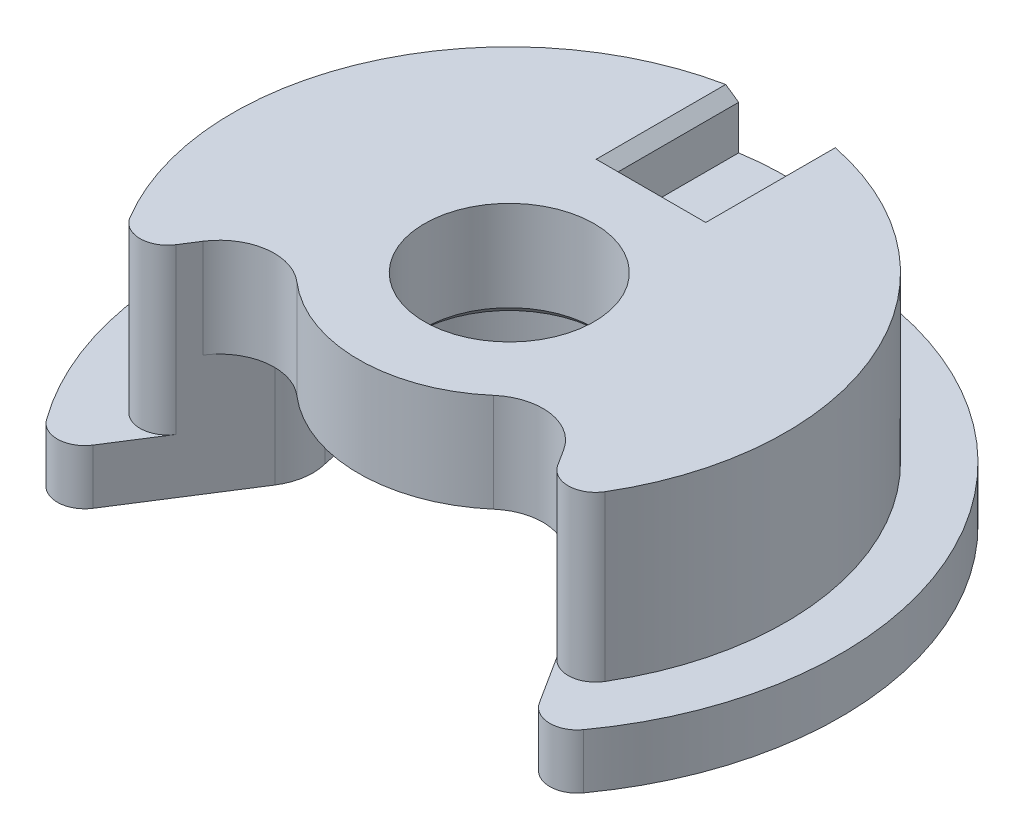
ISO-10303-21;
HEADER;
FILE_DESCRIPTION(('STEP AP214'),'2;1');
FILE_NAME('part.step','',(''),(''),'','','');
FILE_SCHEMA(('AUTOMOTIVE_DESIGN { 1 0 10303 214 1 1 1 1 }'));
ENDSEC;
DATA;
#1=APPLICATION_CONTEXT('core data for automotive mechanical design processes');
#2=APPLICATION_PROTOCOL_DEFINITION('international standard','automotive_design',2000,#1);
#3=PRODUCT_CONTEXT('',#1,'mechanical');
#4=PRODUCT('Part','Part','',(#3));
#5=PRODUCT_RELATED_PRODUCT_CATEGORY('part','',(#4));
#6=PRODUCT_DEFINITION_FORMATION('','',#4);
#7=PRODUCT_DEFINITION_CONTEXT('part definition',#1,'design');
#8=PRODUCT_DEFINITION('design','',#6,#7);
#9=PRODUCT_DEFINITION_SHAPE('','',#8);
#10=(LENGTH_UNIT() NAMED_UNIT(*) SI_UNIT(.MILLI.,.METRE.));
#11=(NAMED_UNIT(*) PLANE_ANGLE_UNIT() SI_UNIT($,.RADIAN.));
#12=(NAMED_UNIT(*) SI_UNIT($,.STERADIAN.) SOLID_ANGLE_UNIT());
#13=UNCERTAINTY_MEASURE_WITH_UNIT(LENGTH_MEASURE(1.E-05),#10,'distance_accuracy_value','');
#14=(GEOMETRIC_REPRESENTATION_CONTEXT(3) GLOBAL_UNCERTAINTY_ASSIGNED_CONTEXT((#13)) GLOBAL_UNIT_ASSIGNED_CONTEXT((#10,
#11,#12)) REPRESENTATION_CONTEXT('',''));
#15=CARTESIAN_POINT('',(0.,0.,0.));
#16=DIRECTION('',(0.,0.,1.));
#17=DIRECTION('',(1.,0.,0.));
#18=AXIS2_PLACEMENT_3D('',#15,#16,#17);
#19=CARTESIAN_POINT('',(0.,3.,0.));
#20=DIRECTION('',(0.,1.,0.));
#21=DIRECTION('',(0.,0.,1.));
#22=AXIS2_PLACEMENT_3D('',#19,#20,#21);
#23=PLANE('',#22);
#24=DIRECTION('',(0.,0.,-1.));
#25=VECTOR('',#24,1.);
#26=CARTESIAN_POINT('',(0.8,3.,-2.786231041578));
#27=LINE('',#26,#25);
#28=CARTESIAN_POINT('',(0.8,3.,-2.786231041578));
#29=VERTEX_POINT('',#28);
#30=CARTESIAN_POINT('',(0.8,3.,-4.9862310415782));
#31=VERTEX_POINT('',#30);
#32=EDGE_CURVE('E226',#29,#31,#27,.T.);
#33=ORIENTED_EDGE('',*,*,#32,.T.);
#34=CARTESIAN_POINT('',(0.,3.,0.));
#35=DIRECTION('',(0.,-1.,0.));
#36=DIRECTION('',(0.,0.,-1.));
#37=AXIS2_PLACEMENT_3D('',#34,#35,#36);
#38=CIRCLE('',#37,5.05);
#39=CARTESIAN_POINT('',(-0.8,3.,-4.9862310415782));
#40=VERTEX_POINT('',#39);
#41=EDGE_CURVE('E20',#31,#40,#38,.F.);
#42=ORIENTED_EDGE('',*,*,#41,.T.);
#43=DIRECTION('',(0.,0.,1.));
#44=VECTOR('',#43,1.);
#45=CARTESIAN_POINT('',(-0.8,3.,-4.986231041578));
#46=LINE('',#45,#44);
#47=CARTESIAN_POINT('',(-0.8,3.,-2.786231041578));
#48=VERTEX_POINT('',#47);
#49=EDGE_CURVE('E235',#40,#48,#46,.T.);
#50=ORIENTED_EDGE('',*,*,#49,.T.);
#51=DIRECTION('',(1.,0.,0.));
#52=VECTOR('',#51,1.);
#53=CARTESIAN_POINT('',(-0.8,3.,-2.786231041578));
#54=LINE('',#53,#52);
#55=EDGE_CURVE('E159',#48,#29,#54,.T.);
#56=ORIENTED_EDGE('',*,*,#55,.T.);
#57=EDGE_LOOP('',(#33,#42,#50,#56));
#58=FACE_BOUND('',#57,.T.);
#59=ADVANCED_FACE('F17',(#58),#23,.T.);
#60=CARTESIAN_POINT('',(-0.8,4.,-2.786231041578));
#61=DIRECTION('',(0.,0.,1.));
#62=DIRECTION('',(1.,0.,0.));
#63=AXIS2_PLACEMENT_3D('',#60,#61,#62);
#64=PLANE('',#63);
#65=ORIENTED_EDGE('',*,*,#55,.F.);
#66=DIRECTION('',(0.,1.,0.));
#67=VECTOR('',#66,1.);
#68=CARTESIAN_POINT('',(-0.8,4.,-2.786231041578));
#69=LINE('',#68,#67);
#70=CARTESIAN_POINT('',(-0.800000000000001,3.8,-2.786231041578));
#71=VERTEX_POINT('',#70);
#72=EDGE_CURVE('E230',#48,#71,#69,.T.);
#73=ORIENTED_EDGE('',*,*,#72,.T.);
#74=DIRECTION('',(1.,0.,0.));
#75=VECTOR('',#74,1.);
#76=CARTESIAN_POINT('',(0.,3.8,-2.786231041578));
#77=LINE('',#76,#75);
#78=CARTESIAN_POINT('',(0.8,3.8,-2.786231041578));
#79=VERTEX_POINT('',#78);
#80=EDGE_CURVE('E218',#79,#71,#77,.F.);
#81=ORIENTED_EDGE('',*,*,#80,.F.);
#82=DIRECTION('',(0.,1.,0.));
#83=VECTOR('',#82,1.);
#84=CARTESIAN_POINT('',(0.8,4.,-2.786231041578));
#85=LINE('',#84,#83);
#86=EDGE_CURVE('E227',#79,#29,#85,.F.);
#87=ORIENTED_EDGE('',*,*,#86,.T.);
#88=EDGE_LOOP('',(#65,#73,#81,#87));
#89=FACE_BOUND('',#88,.T.);
#90=ADVANCED_FACE('F409',(#89),#64,.F.);
#91=CARTESIAN_POINT('',(-0.8,4.,-4.986231041578));
#92=DIRECTION('',(-1.,0.,0.));
#93=DIRECTION('',(0.,0.,1.));
#94=AXIS2_PLACEMENT_3D('',#91,#92,#93);
#95=PLANE('',#94);
#96=ORIENTED_EDGE('',*,*,#49,.F.);
#97=DIRECTION('',(0.,1.,0.));
#98=VECTOR('',#97,1.);
#99=CARTESIAN_POINT('',(-0.8,4.,-4.986231041578));
#100=LINE('',#99,#98);
#101=CARTESIAN_POINT('',(-0.8,3.8,-4.9862310415782));
#102=VERTEX_POINT('',#101);
#103=EDGE_CURVE('E233',#102,#40,#100,.F.);
#104=ORIENTED_EDGE('',*,*,#103,.F.);
#105=DIRECTION('',(0.,0.,1.));
#106=VECTOR('',#105,1.);
#107=CARTESIAN_POINT('',(-0.8,3.8,-3.868115520789));
#108=LINE('',#107,#106);
#109=EDGE_CURVE('E211',#71,#102,#108,.F.);
#110=ORIENTED_EDGE('',*,*,#109,.F.);
#111=ORIENTED_EDGE('',*,*,#72,.F.);
#112=EDGE_LOOP('',(#96,#104,#110,#111));
#113=FACE_BOUND('',#112,.T.);
#114=ADVANCED_FACE('F650',(#113),#95,.F.);
#115=CARTESIAN_POINT('',(0.8,4.,-2.786231041578));
#116=DIRECTION('',(1.,0.,0.));
#117=DIRECTION('',(0.,0.,-1.));
#118=AXIS2_PLACEMENT_3D('',#115,#116,#117);
#119=PLANE('',#118);
#120=ORIENTED_EDGE('',*,*,#32,.F.);
#121=ORIENTED_EDGE('',*,*,#86,.F.);
#122=DIRECTION('',(0.,0.,1.));
#123=VECTOR('',#122,1.);
#124=CARTESIAN_POINT('',(0.8,3.8,-3.868115520789));
#125=LINE('',#124,#123);
#126=CARTESIAN_POINT('',(0.8,3.8,-4.9862310415782));
#127=VERTEX_POINT('',#126);
#128=EDGE_CURVE('E179',#127,#79,#125,.T.);
#129=ORIENTED_EDGE('',*,*,#128,.F.);
#130=DIRECTION('',(0.,1.,0.));
#131=VECTOR('',#130,1.);
#132=CARTESIAN_POINT('',(0.8,4.,-4.986231041578));
#133=LINE('',#132,#131);
#134=EDGE_CURVE('E222',#31,#127,#133,.T.);
#135=ORIENTED_EDGE('',*,*,#134,.F.);
#136=EDGE_LOOP('',(#120,#121,#129,#135));
#137=FACE_BOUND('',#136,.T.);
#138=ADVANCED_FACE('F407',(#137),#119,.F.);
#139=CARTESIAN_POINT('',(0.,3.9,-2.686231041578));
#140=DIRECTION('',(0.,0.707106781186548,-0.707106781186548));
#141=DIRECTION('',(0.,0.707106781186548,0.707106781186548));
#142=AXIS2_PLACEMENT_3D('',#139,#140,#141);
#143=PLANE('',#142);
#144=DIRECTION('',(0.577350269189625,-0.577350269189625,-0.577350269189627));
#145=VECTOR('',#144,1.);
#146=CARTESIAN_POINT('',(-1.,4.,-2.586231041578));
#147=LINE('',#146,#145);
#148=CARTESIAN_POINT('',(-1.,4.,-2.586231041578));
#149=VERTEX_POINT('',#148);
#150=EDGE_CURVE('E197',#149,#71,#147,.T.);
#151=ORIENTED_EDGE('',*,*,#150,.F.);
#152=DIRECTION('',(1.,0.,0.));
#153=VECTOR('',#152,1.);
#154=CARTESIAN_POINT('',(0.,4.,-2.586231041578));
#155=LINE('',#154,#153);
#156=CARTESIAN_POINT('',(1.,4.,-2.586231041578));
#157=VERTEX_POINT('',#156);
#158=EDGE_CURVE('E188',#157,#149,#155,.F.);
#159=ORIENTED_EDGE('',*,*,#158,.F.);
#160=DIRECTION('',(0.577350269189625,0.577350269189625,0.577350269189627));
#161=VECTOR('',#160,1.);
#162=CARTESIAN_POINT('',(0.8,3.8,-2.786231041578));
#163=LINE('',#162,#161);
#164=EDGE_CURVE('E172',#79,#157,#163,.T.);
#165=ORIENTED_EDGE('',*,*,#164,.F.);
#166=ORIENTED_EDGE('',*,*,#80,.T.);
#167=EDGE_LOOP('',(#151,#159,#165,#166));
#168=FACE_BOUND('',#167,.T.);
#169=ADVANCED_FACE('F195',(#168),#143,.T.);
#170=CARTESIAN_POINT('',(-0.9,3.9,-3.868115520789));
#171=DIRECTION('',(0.707106781186548,0.707106781186548,0.));
#172=DIRECTION('',(-0.707106781186548,0.707106781186548,0.));
#173=AXIS2_PLACEMENT_3D('',#170,#171,#172);
#174=PLANE('',#173);
#175=ORIENTED_EDGE('',*,*,#109,.T.);
#176=CARTESIAN_POINT('',(0.,3.,0.));
#177=DIRECTION('',(0.707106781186548,0.707106781186548,0.));
#178=DIRECTION('',(0.707106781186548,-0.707106781186548,0.));
#179=AXIS2_PLACEMENT_3D('',#176,#177,#178);
#180=ELLIPSE('',#179,7.14177848998413,5.05);
#181=CARTESIAN_POINT('',(-1.,4.,-4.95));
#182=VERTEX_POINT('',#181);
#183=EDGE_CURVE('E214',#102,#182,#180,.T.);
#184=ORIENTED_EDGE('',*,*,#183,.T.);
#185=DIRECTION('',(0.,0.,1.));
#186=VECTOR('',#185,1.);
#187=CARTESIAN_POINT('',(-1.,4.,0.));
#188=LINE('',#187,#186);
#189=EDGE_CURVE('E199',#149,#182,#188,.F.);
#190=ORIENTED_EDGE('',*,*,#189,.F.);
#191=ORIENTED_EDGE('',*,*,#150,.T.);
#192=EDGE_LOOP('',(#175,#184,#190,#191));
#193=FACE_BOUND('',#192,.T.);
#194=ADVANCED_FACE('F412',(#193),#174,.T.);
#195=CARTESIAN_POINT('',(0.9,3.9,-3.868115520789));
#196=DIRECTION('',(-0.707106781186548,0.707106781186548,0.));
#197=DIRECTION('',(-0.707106781186548,-0.707106781186548,0.));
#198=AXIS2_PLACEMENT_3D('',#195,#196,#197);
#199=PLANE('',#198);
#200=DIRECTION('',(0.,0.,1.));
#201=VECTOR('',#200,1.);
#202=CARTESIAN_POINT('',(1.,4.,0.));
#203=LINE('',#202,#201);
#204=CARTESIAN_POINT('',(1.,4.,-4.95));
#205=VERTEX_POINT('',#204);
#206=EDGE_CURVE('E176',#205,#157,#203,.T.);
#207=ORIENTED_EDGE('',*,*,#206,.F.);
#208=CARTESIAN_POINT('',(0.,3.,0.));
#209=DIRECTION('',(-0.707106781186548,0.707106781186548,0.));
#210=DIRECTION('',(-0.707106781186548,-0.707106781186548,0.));
#211=AXIS2_PLACEMENT_3D('',#208,#209,#210);
#212=ELLIPSE('',#211,7.14177848998413,5.05);
#213=EDGE_CURVE('E183',#205,#127,#212,.T.);
#214=ORIENTED_EDGE('',*,*,#213,.T.);
#215=ORIENTED_EDGE('',*,*,#128,.T.);
#216=ORIENTED_EDGE('',*,*,#164,.T.);
#217=EDGE_LOOP('',(#207,#214,#215,#216));
#218=FACE_BOUND('',#217,.T.);
#219=ADVANCED_FACE('F174',(#218),#199,.T.);
#220=CARTESIAN_POINT('',(0.,0.,0.));
#221=DIRECTION('',(0.,-1.,0.));
#222=DIRECTION('',(0.,0.,-1.));
#223=AXIS2_PLACEMENT_3D('',#220,#221,#222);
#224=CYLINDRICAL_SURFACE('',#223,1.55);
#225=CARTESIAN_POINT('',(0.,4.,0.));
#226=DIRECTION('',(0.,-1.,0.));
#227=DIRECTION('',(0.,0.,-1.));
#228=AXIS2_PLACEMENT_3D('',#225,#226,#227);
#229=CIRCLE('',#228,1.55);
#230=CARTESIAN_POINT('',(0.,4.,-1.55));
#231=VERTEX_POINT('',#230);
#232=EDGE_CURVE('E192',#231,#231,#229,.T.);
#233=ORIENTED_EDGE('',*,*,#232,.F.);
#234=EDGE_LOOP('',(#233));
#235=FACE_BOUND('',#234,.T.);
#236=CARTESIAN_POINT('',(0.,2.35000000003538,0.));
#237=DIRECTION('',(0.,-1.,0.));
#238=DIRECTION('',(0.,0.,-1.));
#239=AXIS2_PLACEMENT_3D('',#236,#237,#238);
#240=CIRCLE('',#239,1.55000000000882);
#241=CARTESIAN_POINT('',(0.,2.35000000003538,-1.55000000000882));
#242=VERTEX_POINT('',#241);
#243=EDGE_CURVE('E200',#242,#242,#240,.T.);
#244=ORIENTED_EDGE('',*,*,#243,.T.);
#245=EDGE_LOOP('',(#244));
#246=FACE_BOUND('',#245,.T.);
#247=ADVANCED_FACE('F455',(#235,#246),#224,.F.);
#248=CARTESIAN_POINT('',(0.,2.20000000007303,0.));
#249=DIRECTION('',(0.,-1.,0.));
#250=DIRECTION('',(0.,0.,-1.));
#251=AXIS2_PLACEMENT_3D('',#248,#249,#250);
#252=CONICAL_SURFACE('',#251,1.69999999997117,0.785398163397448);
#253=CARTESIAN_POINT('',(0.,2.20000000007303,0.));
#254=DIRECTION('',(0.,-1.,0.));
#255=DIRECTION('',(0.,0.,-1.));
#256=AXIS2_PLACEMENT_3D('',#253,#254,#255);
#257=CIRCLE('',#256,1.69999999997117);
#258=CARTESIAN_POINT('',(0.,2.20000000007303,-1.69999999997117));
#259=VERTEX_POINT('',#258);
#260=EDGE_CURVE('E295',#259,#259,#257,.F.);
#261=ORIENTED_EDGE('',*,*,#260,.F.);
#262=EDGE_LOOP('',(#261));
#263=FACE_BOUND('',#262,.T.);
#264=ORIENTED_EDGE('',*,*,#243,.F.);
#265=EDGE_LOOP('',(#264));
#266=FACE_BOUND('',#265,.T.);
#267=ADVANCED_FACE('F446',(#263,#266),#252,.F.);
#268=CARTESIAN_POINT('',(0.,0.,0.));
#269=DIRECTION('',(0.,-1.,0.));
#270=DIRECTION('',(0.,0.,-1.));
#271=AXIS2_PLACEMENT_3D('',#268,#269,#270);
#272=CYLINDRICAL_SURFACE('',#271,2.75);
#273=CARTESIAN_POINT('',(0.,2.2,0.));
#274=DIRECTION('',(0.,-1.,0.));
#275=DIRECTION('',(0.,0.,-1.));
#276=AXIS2_PLACEMENT_3D('',#273,#274,#275);
#277=CIRCLE('',#276,2.75);
#278=CARTESIAN_POINT('',(1.7973072600179,2.2,2.081390547948));
#279=VERTEX_POINT('',#278);
#280=CARTESIAN_POINT('',(-1.7973072600179,2.2,2.081390547948));
#281=VERTEX_POINT('',#280);
#282=EDGE_CURVE('E302',#279,#281,#277,.T.);
#283=ORIENTED_EDGE('',*,*,#282,.F.);
#284=DIRECTION('',(0.,1.,0.));
#285=VECTOR('',#284,1.);
#286=CARTESIAN_POINT('',(1.797307260018,-5.2144,2.081390547948));
#287=LINE('',#286,#285);
#288=CARTESIAN_POINT('',(1.7973072600179,4.,2.081390547948));
#289=VERTEX_POINT('',#288);
#290=EDGE_CURVE('E287',#279,#289,#287,.T.);
#291=ORIENTED_EDGE('',*,*,#290,.T.);
#292=CARTESIAN_POINT('',(0.,4.,0.));
#293=DIRECTION('',(0.,-1.,0.));
#294=DIRECTION('',(0.,0.,-1.));
#295=AXIS2_PLACEMENT_3D('',#292,#293,#294);
#296=CIRCLE('',#295,2.75);
#297=CARTESIAN_POINT('',(-1.7973072600179,4.,2.081390547948));
#298=VERTEX_POINT('',#297);
#299=EDGE_CURVE('E323',#298,#289,#296,.F.);
#300=ORIENTED_EDGE('',*,*,#299,.F.);
#301=DIRECTION('',(0.,1.,0.));
#302=VECTOR('',#301,1.);
#303=CARTESIAN_POINT('',(-1.797307260018,-5.2144,2.081390547948));
#304=LINE('',#303,#302);
#305=EDGE_CURVE('E310',#298,#281,#304,.F.);
#306=ORIENTED_EDGE('',*,*,#305,.T.);
#307=EDGE_LOOP('',(#283,#291,#300,#306));
#308=FACE_BOUND('',#307,.T.);
#309=ADVANCED_FACE('F444',(#308),#272,.T.);
#310=CARTESIAN_POINT('',(0.,4.,0.));
#311=DIRECTION('',(0.,1.,0.));
#312=DIRECTION('',(0.,0.,1.));
#313=AXIS2_PLACEMENT_3D('',#310,#311,#312);
#314=PLANE('',#313);
#315=ORIENTED_EDGE('',*,*,#232,.T.);
#316=EDGE_LOOP('',(#315));
#317=FACE_BOUND('',#316,.T.);
#318=CARTESIAN_POINT('',(0.,4.,0.));
#319=DIRECTION('',(0.,-1.,0.));
#320=DIRECTION('',(0.,0.,-1.));
#321=AXIS2_PLACEMENT_3D('',#318,#319,#320);
#322=CIRCLE('',#321,5.05);
#323=CARTESIAN_POINT('',(4.33625103973418,4.,2.5883251187598));
#324=VERTEX_POINT('',#323);
#325=EDGE_CURVE('E191',#205,#324,#322,.T.);
#326=ORIENTED_EDGE('',*,*,#325,.F.);
#327=ORIENTED_EDGE('',*,*,#206,.T.);
#328=ORIENTED_EDGE('',*,*,#158,.T.);
#329=ORIENTED_EDGE('',*,*,#189,.T.);
#330=CARTESIAN_POINT('',(0.,4.,0.));
#331=DIRECTION('',(0.,-1.,0.));
#332=DIRECTION('',(0.,0.,-1.));
#333=AXIS2_PLACEMENT_3D('',#330,#331,#332);
#334=CIRCLE('',#333,5.05);
#335=CARTESIAN_POINT('',(-4.33625103973424,4.,2.58832511875984));
#336=VERTEX_POINT('',#335);
#337=EDGE_CURVE('E315',#336,#182,#334,.T.);
#338=ORIENTED_EDGE('',*,*,#337,.F.);
#339=CARTESIAN_POINT('',(-3.906919253622,4.,2.332055305021));
#340=DIRECTION('',(0.,1.,0.));
#341=DIRECTION('',(0.,0.,1.));
#342=AXIS2_PLACEMENT_3D('',#339,#340,#341);
#343=CIRCLE('',#342,0.5);
#344=CARTESIAN_POINT('',(-3.48522353071745,4.,2.60070510919377));
#345=VERTEX_POINT('',#344);
#346=EDGE_CURVE('E311',#345,#336,#343,.F.);
#347=ORIENTED_EDGE('',*,*,#346,.F.);
#348=DIRECTION('',(0.537299608347189,0.,-0.843391445812653));
#349=VECTOR('',#348,1.);
#350=CARTESIAN_POINT('',(-3.485223530716,4.,2.600705109195));
#351=LINE('',#350,#349);
#352=CARTESIAN_POINT('',(-3.29426498220257,4.,2.3009602297628));
#353=VERTEX_POINT('',#352);
#354=EDGE_CURVE('E202',#345,#353,#351,.T.);
#355=ORIENTED_EDGE('',*,*,#354,.T.);
#356=CARTESIAN_POINT('',(-2.450873536388,4.,2.838259838111));
#357=DIRECTION('',(0.,1.,0.));
#358=DIRECTION('',(0.,0.,1.));
#359=AXIS2_PLACEMENT_3D('',#356,#357,#358);
#360=CIRCLE('',#359,1.);
#361=EDGE_CURVE('E307',#353,#298,#360,.F.);
#362=ORIENTED_EDGE('',*,*,#361,.T.);
#363=ORIENTED_EDGE('',*,*,#299,.T.);
#364=CARTESIAN_POINT('',(2.450873536388,4.,2.838259838111));
#365=DIRECTION('',(0.,1.,0.));
#366=DIRECTION('',(0.,0.,1.));
#367=AXIS2_PLACEMENT_3D('',#364,#365,#366);
#368=CIRCLE('',#367,1.);
#369=CARTESIAN_POINT('',(3.29426498220077,4.,2.30096022976394));
#370=VERTEX_POINT('',#369);
#371=EDGE_CURVE('E284',#289,#370,#368,.F.);
#372=ORIENTED_EDGE('',*,*,#371,.T.);
#373=DIRECTION('',(0.537299608347189,0.,0.843391445812653));
#374=VECTOR('',#373,1.);
#375=CARTESIAN_POINT('',(3.294264982201,4.,2.300960229764));
#376=LINE('',#375,#374);
#377=CARTESIAN_POINT('',(3.48522353071566,4.,2.60070510919491));
#378=VERTEX_POINT('',#377);
#379=EDGE_CURVE('E322',#370,#378,#376,.T.);
#380=ORIENTED_EDGE('',*,*,#379,.T.);
#381=CARTESIAN_POINT('',(3.906919253622,4.,2.332055305021));
#382=DIRECTION('',(0.,-1.,0.));
#383=DIRECTION('',(0.,0.,-1.));
#384=AXIS2_PLACEMENT_3D('',#381,#382,#383);
#385=CIRCLE('',#384,0.5);
#386=EDGE_CURVE('E193',#378,#324,#385,.F.);
#387=ORIENTED_EDGE('',*,*,#386,.T.);
#388=EDGE_LOOP('',(#326,#327,#328,#329,#338,#347,#355,#362,#363,#372,#380,#387));
#389=FACE_BOUND('',#388,.T.);
#390=ADVANCED_FACE('F186',(#317,#389),#314,.T.);
#391=CARTESIAN_POINT('',(0.,1.,0.));
#392=DIRECTION('',(0.,-1.,0.));
#393=DIRECTION('',(0.,0.,-1.));
#394=AXIS2_PLACEMENT_3D('',#391,#392,#393);
#395=CYLINDRICAL_SURFACE('',#394,5.05);
#396=ORIENTED_EDGE('',*,*,#134,.T.);
#397=ORIENTED_EDGE('',*,*,#213,.F.);
#398=ORIENTED_EDGE('',*,*,#325,.T.);
#399=DIRECTION('',(0.,-1.,0.));
#400=VECTOR('',#399,1.);
#401=CARTESIAN_POINT('',(4.33625103973405,9.2144,2.58832511876003));
#402=LINE('',#401,#400);
#403=CARTESIAN_POINT('',(4.33625103973424,1.,2.58832511875984));
#404=VERTEX_POINT('',#403);
#405=EDGE_CURVE('E283',#404,#324,#402,.F.);
#406=ORIENTED_EDGE('',*,*,#405,.F.);
#407=CARTESIAN_POINT('',(0.,1.,0.));
#408=DIRECTION('',(0.,-1.,0.));
#409=DIRECTION('',(0.,0.,-1.));
#410=AXIS2_PLACEMENT_3D('',#407,#408,#409);
#411=CIRCLE('',#410,5.05);
#412=CARTESIAN_POINT('',(-4.33625103973418,1.,2.5883251187598));
#413=VERTEX_POINT('',#412);
#414=EDGE_CURVE('E277',#404,#413,#411,.F.);
#415=ORIENTED_EDGE('',*,*,#414,.T.);
#416=DIRECTION('',(0.,1.,0.));
#417=VECTOR('',#416,1.);
#418=CARTESIAN_POINT('',(-4.33625103973405,-5.2144,2.58832511876003));
#419=LINE('',#418,#417);
#420=EDGE_CURVE('E314',#336,#413,#419,.F.);
#421=ORIENTED_EDGE('',*,*,#420,.F.);
#422=ORIENTED_EDGE('',*,*,#337,.T.);
#423=ORIENTED_EDGE('',*,*,#183,.F.);
#424=ORIENTED_EDGE('',*,*,#103,.T.);
#425=ORIENTED_EDGE('',*,*,#41,.F.);
#426=EDGE_LOOP('',(#396,#397,#398,#406,#415,#421,#422,#423,#424,#425));
#427=FACE_BOUND('',#426,.T.);
#428=ADVANCED_FACE('F405',(#427),#395,.T.);
#429=CARTESIAN_POINT('',(-3.906919253622,-5.2144,2.332055305021));
#430=DIRECTION('',(0.,1.,0.));
#431=DIRECTION('',(0.,0.,1.));
#432=AXIS2_PLACEMENT_3D('',#429,#430,#431);
#433=CYLINDRICAL_SURFACE('',#432,0.5);
#434=DIRECTION('',(0.,1.,0.));
#435=VECTOR('',#434,1.);
#436=CARTESIAN_POINT('',(-3.48522353071918,0.,2.60070510919297));
#437=LINE('',#436,#435);
#438=CARTESIAN_POINT('',(-3.48522353071898,1.,2.60070510919266));
#439=VERTEX_POINT('',#438);
#440=EDGE_CURVE('E273',#439,#345,#437,.T.);
#441=ORIENTED_EDGE('',*,*,#440,.T.);
#442=ORIENTED_EDGE('',*,*,#346,.T.);
#443=ORIENTED_EDGE('',*,*,#420,.T.);
#444=CARTESIAN_POINT('',(-3.906919253622,1.,2.332055305021));
#445=DIRECTION('',(0.,1.,0.));
#446=DIRECTION('',(0.,0.,1.));
#447=AXIS2_PLACEMENT_3D('',#444,#445,#446);
#448=CIRCLE('',#447,0.5);
#449=EDGE_CURVE('E274',#413,#439,#448,.T.);
#450=ORIENTED_EDGE('',*,*,#449,.T.);
#451=EDGE_LOOP('',(#441,#442,#443,#450));
#452=FACE_BOUND('',#451,.T.);
#453=ADVANCED_FACE('F417',(#452),#433,.T.);
#454=CARTESIAN_POINT('',(-2.450873536388,-5.2144,2.838259838111));
#455=DIRECTION('',(0.,1.,0.));
#456=DIRECTION('',(0.,0.,1.));
#457=AXIS2_PLACEMENT_3D('',#454,#455,#456);
#458=CYLINDRICAL_SURFACE('',#457,1.);
#459=DIRECTION('',(0.,1.,0.));
#460=VECTOR('',#459,1.);
#461=CARTESIAN_POINT('',(-3.29426498220432,0.,2.30096022976188));
#462=LINE('',#461,#460);
#463=CARTESIAN_POINT('',(-3.29426498220435,2.2,2.30096022976193));
#464=VERTEX_POINT('',#463);
#465=EDGE_CURVE('E348',#353,#464,#462,.F.);
#466=ORIENTED_EDGE('',*,*,#465,.T.);
#467=CARTESIAN_POINT('',(-2.450873536388,2.2,2.838259838111));
#468=DIRECTION('',(0.,1.,0.));
#469=DIRECTION('',(0.,0.,1.));
#470=AXIS2_PLACEMENT_3D('',#467,#468,#469);
#471=CIRCLE('',#470,1.);
#472=EDGE_CURVE('E300',#281,#464,#471,.T.);
#473=ORIENTED_EDGE('',*,*,#472,.F.);
#474=ORIENTED_EDGE('',*,*,#305,.F.);
#475=ORIENTED_EDGE('',*,*,#361,.F.);
#476=EDGE_LOOP('',(#466,#473,#474,#475));
#477=FACE_BOUND('',#476,.T.);
#478=ADVANCED_FACE('F434',(#477),#458,.F.);
#479=CARTESIAN_POINT('',(-3.625222931046,9.2144,0.9593011519948));
#480=DIRECTION('',(0.,-1.,0.));
#481=DIRECTION('',(0.,0.,-1.));
#482=AXIS2_PLACEMENT_3D('',#479,#480,#481);
#483=CYLINDRICAL_SURFACE('',#482,1.);
#484=DIRECTION('',(0.,1.,0.));
#485=VECTOR('',#484,1.);
#486=CARTESIAN_POINT('',(-2.78183148523659,0.,1.49660076033971));
#487=LINE('',#486,#485);
#488=CARTESIAN_POINT('',(-2.78183148523651,2.2,1.49660076033959));
#489=VERTEX_POINT('',#488);
#490=CARTESIAN_POINT('',(-2.78183148523472,0.,1.49660076034074));
#491=VERTEX_POINT('',#490);
#492=EDGE_CURVE('E354',#489,#491,#487,.F.);
#493=ORIENTED_EDGE('',*,*,#492,.T.);
#494=CARTESIAN_POINT('',(-3.625222931046,0.,0.9593011519948));
#495=DIRECTION('',(0.,-1.,0.));
#496=DIRECTION('',(0.,0.,-1.));
#497=AXIS2_PLACEMENT_3D('',#494,#495,#496);
#498=CIRCLE('',#497,1.);
#499=CARTESIAN_POINT('',(-2.65849681610037,0.,0.703487511462923));
#500=VERTEX_POINT('',#499);
#501=EDGE_CURVE('E305',#491,#500,#498,.F.);
#502=ORIENTED_EDGE('',*,*,#501,.T.);
#503=DIRECTION('',(0.,-1.,0.));
#504=VECTOR('',#503,1.);
#505=CARTESIAN_POINT('',(-2.65849681610033,0.,0.703487511462989));
#506=LINE('',#505,#504);
#507=CARTESIAN_POINT('',(-2.65849681610037,2.2,0.703487511462923));
#508=VERTEX_POINT('',#507);
#509=EDGE_CURVE('E270',#500,#508,#506,.F.);
#510=ORIENTED_EDGE('',*,*,#509,.T.);
#511=CARTESIAN_POINT('',(-3.625222931046,2.2,0.9593011519948));
#512=DIRECTION('',(0.,-1.,0.));
#513=DIRECTION('',(0.,0.,-1.));
#514=AXIS2_PLACEMENT_3D('',#511,#512,#513);
#515=CIRCLE('',#514,1.);
#516=EDGE_CURVE('E298',#489,#508,#515,.F.);
#517=ORIENTED_EDGE('',*,*,#516,.F.);
#518=EDGE_LOOP('',(#493,#502,#510,#517));
#519=FACE_BOUND('',#518,.T.);
#520=ADVANCED_FACE('F490',(#519),#483,.T.);
#521=CARTESIAN_POINT('',(0.,2.2,0.));
#522=DIRECTION('',(0.,-1.,0.));
#523=DIRECTION('',(0.,0.,-1.));
#524=AXIS2_PLACEMENT_3D('',#521,#522,#523);
#525=PLANE('',#524);
#526=ORIENTED_EDGE('',*,*,#260,.T.);
#527=EDGE_LOOP('',(#526));
#528=FACE_BOUND('',#527,.T.);
#529=ORIENTED_EDGE('',*,*,#516,.T.);
#530=CARTESIAN_POINT('',(0.,2.2,0.));
#531=DIRECTION('',(0.,-1.,0.));
#532=DIRECTION('',(0.,0.,-1.));
#533=AXIS2_PLACEMENT_3D('',#530,#531,#532);
#534=CIRCLE('',#533,2.75);
#535=CARTESIAN_POINT('',(2.65849681610037,2.2,0.703487511462922));
#536=VERTEX_POINT('',#535);
#537=EDGE_CURVE('E266',#508,#536,#534,.T.);
#538=ORIENTED_EDGE('',*,*,#537,.T.);
#539=CARTESIAN_POINT('',(3.625222931046,2.2,0.9593011519948));
#540=DIRECTION('',(0.,1.,0.));
#541=DIRECTION('',(0.,0.,1.));
#542=AXIS2_PLACEMENT_3D('',#539,#540,#541);
#543=CIRCLE('',#542,1.);
#544=CARTESIAN_POINT('',(2.78183148523301,2.2,1.49660076034202));
#545=VERTEX_POINT('',#544);
#546=EDGE_CURVE('E293',#545,#536,#543,.F.);
#547=ORIENTED_EDGE('',*,*,#546,.F.);
#548=DIRECTION('',(0.537299608347085,0.,0.84339144581272));
#549=VECTOR('',#548,1.);
#550=CARTESIAN_POINT('',(2.781831485233,2.2,1.496600760342));
#551=LINE('',#550,#549);
#552=CARTESIAN_POINT('',(3.2942649822008,2.2,2.30096022976399));
#553=VERTEX_POINT('',#552);
#554=EDGE_CURVE('E304',#545,#553,#551,.T.);
#555=ORIENTED_EDGE('',*,*,#554,.T.);
#556=CARTESIAN_POINT('',(2.450873536388,2.2,2.838259838111));
#557=DIRECTION('',(0.,1.,0.));
#558=DIRECTION('',(0.,0.,1.));
#559=AXIS2_PLACEMENT_3D('',#556,#557,#558);
#560=CIRCLE('',#559,1.);
#561=EDGE_CURVE('E288',#553,#279,#560,.T.);
#562=ORIENTED_EDGE('',*,*,#561,.T.);
#563=ORIENTED_EDGE('',*,*,#282,.T.);
#564=ORIENTED_EDGE('',*,*,#472,.T.);
#565=DIRECTION('',(-0.5372996083468,0.,0.843391445812901));
#566=VECTOR('',#565,1.);
#567=CARTESIAN_POINT('',(-13.10883712567,2.2,17.70675256894));
#568=LINE('',#567,#566);
#569=EDGE_CURVE('E351',#464,#489,#568,.F.);
#570=ORIENTED_EDGE('',*,*,#569,.T.);
#571=EDGE_LOOP('',(#529,#538,#547,#555,#562,#563,#564,#570));
#572=FACE_BOUND('',#571,.T.);
#573=ADVANCED_FACE('F430',(#528,#572),#525,.T.);
#574=CARTESIAN_POINT('',(3.625222931046,-5.2144,0.9593011519948));
#575=DIRECTION('',(0.,1.,0.));
#576=DIRECTION('',(0.,0.,1.));
#577=AXIS2_PLACEMENT_3D('',#574,#575,#576);
#578=CYLINDRICAL_SURFACE('',#577,1.);
#579=CARTESIAN_POINT('',(3.625222931046,0.,0.9593011519948));
#580=DIRECTION('',(0.,1.,0.));
#581=DIRECTION('',(0.,0.,1.));
#582=AXIS2_PLACEMENT_3D('',#579,#580,#581);
#583=CIRCLE('',#582,1.);
#584=CARTESIAN_POINT('',(2.65849681610037,0.,0.703487511462922));
#585=VERTEX_POINT('',#584);
#586=CARTESIAN_POINT('',(2.78183148523292,0.,1.49660076034188));
#587=VERTEX_POINT('',#586);
#588=EDGE_CURVE('E291',#585,#587,#583,.T.);
#589=ORIENTED_EDGE('',*,*,#588,.T.);
#590=DIRECTION('',(0.,1.,0.));
#591=VECTOR('',#590,1.);
#592=CARTESIAN_POINT('',(2.781831485233,0.,1.496600760342));
#593=LINE('',#592,#591);
#594=EDGE_CURVE('E269',#587,#545,#593,.T.);
#595=ORIENTED_EDGE('',*,*,#594,.T.);
#596=ORIENTED_EDGE('',*,*,#546,.T.);
#597=DIRECTION('',(0.,-1.,0.));
#598=VECTOR('',#597,1.);
#599=CARTESIAN_POINT('',(2.65849681610033,0.,0.703487511462988));
#600=LINE('',#599,#598);
#601=EDGE_CURVE('E360',#536,#585,#600,.T.);
#602=ORIENTED_EDGE('',*,*,#601,.T.);
#603=EDGE_LOOP('',(#589,#595,#596,#602));
#604=FACE_BOUND('',#603,.T.);
#605=ADVANCED_FACE('F484',(#604),#578,.T.);
#606=CARTESIAN_POINT('',(2.450873536388,-5.2144,2.838259838111));
#607=DIRECTION('',(0.,1.,0.));
#608=DIRECTION('',(0.,0.,1.));
#609=AXIS2_PLACEMENT_3D('',#606,#607,#608);
#610=CYLINDRICAL_SURFACE('',#609,1.);
#611=ORIENTED_EDGE('',*,*,#290,.F.);
#612=ORIENTED_EDGE('',*,*,#561,.F.);
#613=DIRECTION('',(0.,1.,0.));
#614=VECTOR('',#613,1.);
#615=CARTESIAN_POINT('',(3.29426498220073,0.,2.30096022976417));
#616=LINE('',#615,#614);
#617=EDGE_CURVE('E333',#553,#370,#616,.T.);
#618=ORIENTED_EDGE('',*,*,#617,.T.);
#619=ORIENTED_EDGE('',*,*,#371,.F.);
#620=EDGE_LOOP('',(#611,#612,#618,#619));
#621=FACE_BOUND('',#620,.T.);
#622=ADVANCED_FACE('F441',(#621),#610,.F.);
#623=CARTESIAN_POINT('',(3.906919253622,9.2144,2.332055305021));
#624=DIRECTION('',(0.,-1.,0.));
#625=DIRECTION('',(0.,0.,-1.));
#626=AXIS2_PLACEMENT_3D('',#623,#624,#625);
#627=CYLINDRICAL_SURFACE('',#626,0.5);
#628=ORIENTED_EDGE('',*,*,#386,.F.);
#629=DIRECTION('',(0.,1.,0.));
#630=VECTOR('',#629,1.);
#631=CARTESIAN_POINT('',(3.48522353071559,0.,2.60070510919526));
#632=LINE('',#631,#630);
#633=CARTESIAN_POINT('',(3.48522353071539,0.999999999999999,2.60070510919495));
#634=VERTEX_POINT('',#633);
#635=EDGE_CURVE('E336',#378,#634,#632,.F.);
#636=ORIENTED_EDGE('',*,*,#635,.T.);
#637=CARTESIAN_POINT('',(3.906919253622,0.999999999999999,2.332055305021));
#638=DIRECTION('',(0.,-1.,0.));
#639=DIRECTION('',(0.,0.,-1.));
#640=AXIS2_PLACEMENT_3D('',#637,#638,#639);
#641=CIRCLE('',#640,0.5);
#642=EDGE_CURVE('E280',#634,#404,#641,.F.);
#643=ORIENTED_EDGE('',*,*,#642,.T.);
#644=ORIENTED_EDGE('',*,*,#405,.T.);
#645=EDGE_LOOP('',(#628,#636,#643,#644));
#646=FACE_BOUND('',#645,.T.);
#647=ADVANCED_FACE('F404',(#646),#627,.T.);
#648=CARTESIAN_POINT('',(0.,1.,0.));
#649=DIRECTION('',(0.,-1.,0.));
#650=DIRECTION('',(0.,0.,-1.));
#651=AXIS2_PLACEMENT_3D('',#648,#649,#650);
#652=PLANE('',#651);
#653=CARTESIAN_POINT('',(0.,1.,0.));
#654=DIRECTION('',(0.,1.,0.));
#655=DIRECTION('',(0.,0.,1.));
#656=AXIS2_PLACEMENT_3D('',#653,#654,#655);
#657=CIRCLE('',#656,6.05);
#658=CARTESIAN_POINT('',(-4.90003592224642,1.,3.54854166675473));
#659=VERTEX_POINT('',#658);
#660=CARTESIAN_POINT('',(4.90003592224644,1.,3.54854166675474));
#661=VERTEX_POINT('',#660);
#662=EDGE_CURVE('E260',#659,#661,#657,.F.);
#663=ORIENTED_EDGE('',*,*,#662,.F.);
#664=CARTESIAN_POINT('',(-4.49507427578,1.,3.255273760411));
#665=DIRECTION('',(0.,1.,0.));
#666=DIRECTION('',(0.,0.,1.));
#667=AXIS2_PLACEMENT_3D('',#664,#665,#666);
#668=CIRCLE('',#667,0.5);
#669=CARTESIAN_POINT('',(-4.07337855287652,1.,3.52392356458263));
#670=VERTEX_POINT('',#669);
#671=EDGE_CURVE('E271',#670,#659,#668,.F.);
#672=ORIENTED_EDGE('',*,*,#671,.F.);
#673=DIRECTION('',(-0.5372996083468,0.,0.843391445812901));
#674=VECTOR('',#673,1.);
#675=CARTESIAN_POINT('',(-13.10883712567,1.,17.70675256894));
#676=LINE('',#675,#674);
#677=EDGE_CURVE('E357',#670,#439,#676,.F.);
#678=ORIENTED_EDGE('',*,*,#677,.T.);
#679=ORIENTED_EDGE('',*,*,#449,.F.);
#680=ORIENTED_EDGE('',*,*,#414,.F.);
#681=ORIENTED_EDGE('',*,*,#642,.F.);
#682=DIRECTION('',(-0.5372996083468,0.,-0.843391445812901));
#683=VECTOR('',#682,1.);
#684=CARTESIAN_POINT('',(2.523965560062,1.,1.091832336771));
#685=LINE('',#684,#683);
#686=CARTESIAN_POINT('',(4.07337855287327,0.999999999999999,3.5239235645847));
#687=VERTEX_POINT('',#686);
#688=EDGE_CURVE('E265',#634,#687,#685,.F.);
#689=ORIENTED_EDGE('',*,*,#688,.T.);
#690=CARTESIAN_POINT('',(4.49507427578,0.999999999999999,3.255273760411));
#691=DIRECTION('',(0.,-1.,0.));
#692=DIRECTION('',(0.,0.,-1.));
#693=AXIS2_PLACEMENT_3D('',#690,#691,#692);
#694=CIRCLE('',#693,0.5);
#695=EDGE_CURVE('E263',#661,#687,#694,.T.);
#696=ORIENTED_EDGE('',*,*,#695,.F.);
#697=EDGE_LOOP('',(#663,#672,#678,#679,#680,#681,#689,#696));
#698=FACE_BOUND('',#697,.T.);
#699=ADVANCED_FACE('F400',(#698),#652,.F.);
#700=CARTESIAN_POINT('',(-4.49507427578,-5.2144,3.255273760411));
#701=DIRECTION('',(0.,1.,0.));
#702=DIRECTION('',(0.,0.,1.));
#703=AXIS2_PLACEMENT_3D('',#700,#701,#702);
#704=CYLINDRICAL_SURFACE('',#703,0.5);
#705=DIRECTION('',(0.,1.,0.));
#706=VECTOR('',#705,1.);
#707=CARTESIAN_POINT('',(-4.07337855287658,0.,3.52392356458272));
#708=LINE('',#707,#706);
#709=CARTESIAN_POINT('',(-4.07337855287473,0.,3.52392356458377));
#710=VERTEX_POINT('',#709);
#711=EDGE_CURVE('E361',#710,#670,#708,.T.);
#712=ORIENTED_EDGE('',*,*,#711,.T.);
#713=ORIENTED_EDGE('',*,*,#671,.T.);
#714=DIRECTION('',(0.,1.,0.));
#715=VECTOR('',#714,1.);
#716=CARTESIAN_POINT('',(-4.90003592224616,0.,3.54854166675512));
#717=LINE('',#716,#715);
#718=CARTESIAN_POINT('',(-4.90003592224642,0.,3.54854166675473));
#719=VERTEX_POINT('',#718);
#720=EDGE_CURVE('E259',#719,#659,#717,.T.);
#721=ORIENTED_EDGE('',*,*,#720,.F.);
#722=CARTESIAN_POINT('',(-4.49507427578,0.,3.255273760411));
#723=DIRECTION('',(0.,1.,0.));
#724=DIRECTION('',(0.,0.,1.));
#725=AXIS2_PLACEMENT_3D('',#722,#723,#724);
#726=CIRCLE('',#725,0.5);
#727=EDGE_CURVE('E256',#719,#710,#726,.T.);
#728=ORIENTED_EDGE('',*,*,#727,.T.);
#729=EDGE_LOOP('',(#712,#713,#721,#728));
#730=FACE_BOUND('',#729,.T.);
#731=ADVANCED_FACE('F423',(#730),#704,.T.);
#732=CARTESIAN_POINT('',(-13.10883712567,0.,17.70675256894));
#733=DIRECTION('',(-0.843391445812901,0.,-0.5372996083468));
#734=DIRECTION('',(-0.5372996083468,0.,0.843391445812901));
#735=AXIS2_PLACEMENT_3D('',#732,#733,#734);
#736=PLANE('',#735);
#737=ORIENTED_EDGE('',*,*,#711,.F.);
#738=DIRECTION('',(0.537299608346804,0.,-0.843391445812898));
#739=VECTOR('',#738,1.);
#740=CARTESIAN_POINT('',(-4.073378552873,0.,3.523923564585));
#741=LINE('',#740,#739);
#742=EDGE_CURVE('E255',#710,#491,#741,.T.);
#743=ORIENTED_EDGE('',*,*,#742,.T.);
#744=ORIENTED_EDGE('',*,*,#492,.F.);
#745=ORIENTED_EDGE('',*,*,#569,.F.);
#746=ORIENTED_EDGE('',*,*,#465,.F.);
#747=ORIENTED_EDGE('',*,*,#354,.F.);
#748=ORIENTED_EDGE('',*,*,#440,.F.);
#749=ORIENTED_EDGE('',*,*,#677,.F.);
#750=EDGE_LOOP('',(#737,#743,#744,#745,#746,#747,#748,#749));
#751=FACE_BOUND('',#750,.T.);
#752=ADVANCED_FACE('F420',(#751),#736,.F.);
#753=CARTESIAN_POINT('',(0.,0.,0.));
#754=DIRECTION('',(0.,-1.,0.));
#755=DIRECTION('',(0.,0.,-1.));
#756=AXIS2_PLACEMENT_3D('',#753,#754,#755);
#757=CYLINDRICAL_SURFACE('',#756,2.75);
#758=ORIENTED_EDGE('',*,*,#509,.F.);
#759=CARTESIAN_POINT('',(0.,0.,0.));
#760=DIRECTION('',(0.,-1.,0.));
#761=DIRECTION('',(0.,0.,-1.));
#762=AXIS2_PLACEMENT_3D('',#759,#760,#761);
#763=CIRCLE('',#762,2.75);
#764=EDGE_CURVE('E252',#500,#585,#763,.T.);
#765=ORIENTED_EDGE('',*,*,#764,.T.);
#766=ORIENTED_EDGE('',*,*,#601,.F.);
#767=ORIENTED_EDGE('',*,*,#537,.F.);
#768=EDGE_LOOP('',(#758,#765,#766,#767));
#769=FACE_BOUND('',#768,.T.);
#770=ADVANCED_FACE('F470',(#769),#757,.F.);
#771=CARTESIAN_POINT('',(2.523965560062,0.,1.091832336771));
#772=DIRECTION('',(0.843391445812901,0.,-0.5372996083468));
#773=DIRECTION('',(-0.5372996083468,0.,-0.843391445812901));
#774=AXIS2_PLACEMENT_3D('',#771,#772,#773);
#775=PLANE('',#774);
#776=ORIENTED_EDGE('',*,*,#635,.F.);
#777=ORIENTED_EDGE('',*,*,#379,.F.);
#778=ORIENTED_EDGE('',*,*,#617,.F.);
#779=ORIENTED_EDGE('',*,*,#554,.F.);
#780=ORIENTED_EDGE('',*,*,#594,.F.);
#781=DIRECTION('',(0.537299608346804,0.,0.843391445812898));
#782=VECTOR('',#781,1.);
#783=CARTESIAN_POINT('',(2.781831485233,0.,1.496600760342));
#784=LINE('',#783,#782);
#785=CARTESIAN_POINT('',(4.07337855287328,0.,3.5239235645847));
#786=VERTEX_POINT('',#785);
#787=EDGE_CURVE('E251',#587,#786,#784,.T.);
#788=ORIENTED_EDGE('',*,*,#787,.T.);
#789=DIRECTION('',(0.,-1.,0.));
#790=VECTOR('',#789,1.);
#791=CARTESIAN_POINT('',(4.07337855287366,9.2144,3.52392356458458));
#792=LINE('',#791,#790);
#793=EDGE_CURVE('E262',#687,#786,#792,.T.);
#794=ORIENTED_EDGE('',*,*,#793,.F.);
#795=ORIENTED_EDGE('',*,*,#688,.F.);
#796=EDGE_LOOP('',(#776,#777,#778,#779,#780,#788,#794,#795));
#797=FACE_BOUND('',#796,.T.);
#798=ADVANCED_FACE('F389',(#797),#775,.F.);
#799=CARTESIAN_POINT('',(4.49507427578,9.2144,3.255273760411));
#800=DIRECTION('',(0.,-1.,0.));
#801=DIRECTION('',(0.,0.,-1.));
#802=AXIS2_PLACEMENT_3D('',#799,#800,#801);
#803=CYLINDRICAL_SURFACE('',#802,0.5);
#804=ORIENTED_EDGE('',*,*,#793,.T.);
#805=CARTESIAN_POINT('',(4.49507427578,0.,3.255273760411));
#806=DIRECTION('',(0.,-1.,0.));
#807=DIRECTION('',(0.,0.,-1.));
#808=AXIS2_PLACEMENT_3D('',#805,#806,#807);
#809=CIRCLE('',#808,0.5);
#810=CARTESIAN_POINT('',(4.90003592224644,0.,3.54854166675474));
#811=VERTEX_POINT('',#810);
#812=EDGE_CURVE('E26',#786,#811,#809,.F.);
#813=ORIENTED_EDGE('',*,*,#812,.T.);
#814=DIRECTION('',(0.,1.,0.));
#815=VECTOR('',#814,1.);
#816=CARTESIAN_POINT('',(4.90003592224616,0.,3.54854166675512));
#817=LINE('',#816,#815);
#818=EDGE_CURVE('E34',#661,#811,#817,.F.);
#819=ORIENTED_EDGE('',*,*,#818,.F.);
#820=ORIENTED_EDGE('',*,*,#695,.T.);
#821=EDGE_LOOP('',(#804,#813,#819,#820));
#822=FACE_BOUND('',#821,.T.);
#823=ADVANCED_FACE('F396',(#822),#803,.T.);
#824=CARTESIAN_POINT('',(0.,0.,0.));
#825=DIRECTION('',(0.,1.,0.));
#826=DIRECTION('',(0.,0.,1.));
#827=AXIS2_PLACEMENT_3D('',#824,#825,#826);
#828=CYLINDRICAL_SURFACE('',#827,6.05);
#829=CARTESIAN_POINT('',(0.,0.,0.));
#830=DIRECTION('',(0.,1.,0.));
#831=DIRECTION('',(0.,0.,1.));
#832=AXIS2_PLACEMENT_3D('',#829,#830,#831);
#833=CIRCLE('',#832,6.05);
#834=EDGE_CURVE('E11',#811,#719,#833,.T.);
#835=ORIENTED_EDGE('',*,*,#834,.T.);
#836=ORIENTED_EDGE('',*,*,#720,.T.);
#837=ORIENTED_EDGE('',*,*,#662,.T.);
#838=ORIENTED_EDGE('',*,*,#818,.T.);
#839=EDGE_LOOP('',(#835,#836,#837,#838));
#840=FACE_BOUND('',#839,.T.);
#841=ADVANCED_FACE('F459',(#840),#828,.T.);
#842=CARTESIAN_POINT('',(0.,0.,0.));
#843=DIRECTION('',(0.,1.,0.));
#844=DIRECTION('',(0.,0.,1.));
#845=AXIS2_PLACEMENT_3D('',#842,#843,#844);
#846=PLANE('',#845);
#847=ORIENTED_EDGE('',*,*,#812,.F.);
#848=ORIENTED_EDGE('',*,*,#787,.F.);
#849=ORIENTED_EDGE('',*,*,#588,.F.);
#850=ORIENTED_EDGE('',*,*,#764,.F.);
#851=ORIENTED_EDGE('',*,*,#501,.F.);
#852=ORIENTED_EDGE('',*,*,#742,.F.);
#853=ORIENTED_EDGE('',*,*,#727,.F.);
#854=ORIENTED_EDGE('',*,*,#834,.F.);
#855=EDGE_LOOP('',(#847,#848,#849,#850,#851,#852,#853,#854));
#856=FACE_BOUND('',#855,.T.);
#857=ADVANCED_FACE('F393',(#856),#846,.F.);
#858=CLOSED_SHELL('',(#59,#90,#114,#138,#169,#194,#219,#247,#267,#309,#390,#428,#453,#478,#520,
#573,#605,#622,#647,#699,#731,#752,#770,#798,#823,#841,#857));
#859=MANIFOLD_SOLID_BREP('B1',#858);
#860=ADVANCED_BREP_SHAPE_REPRESENTATION('',(#18,#859),#14);
#861=SHAPE_DEFINITION_REPRESENTATION(#9,#860);
ENDSEC;
END-ISO-10303-21;
